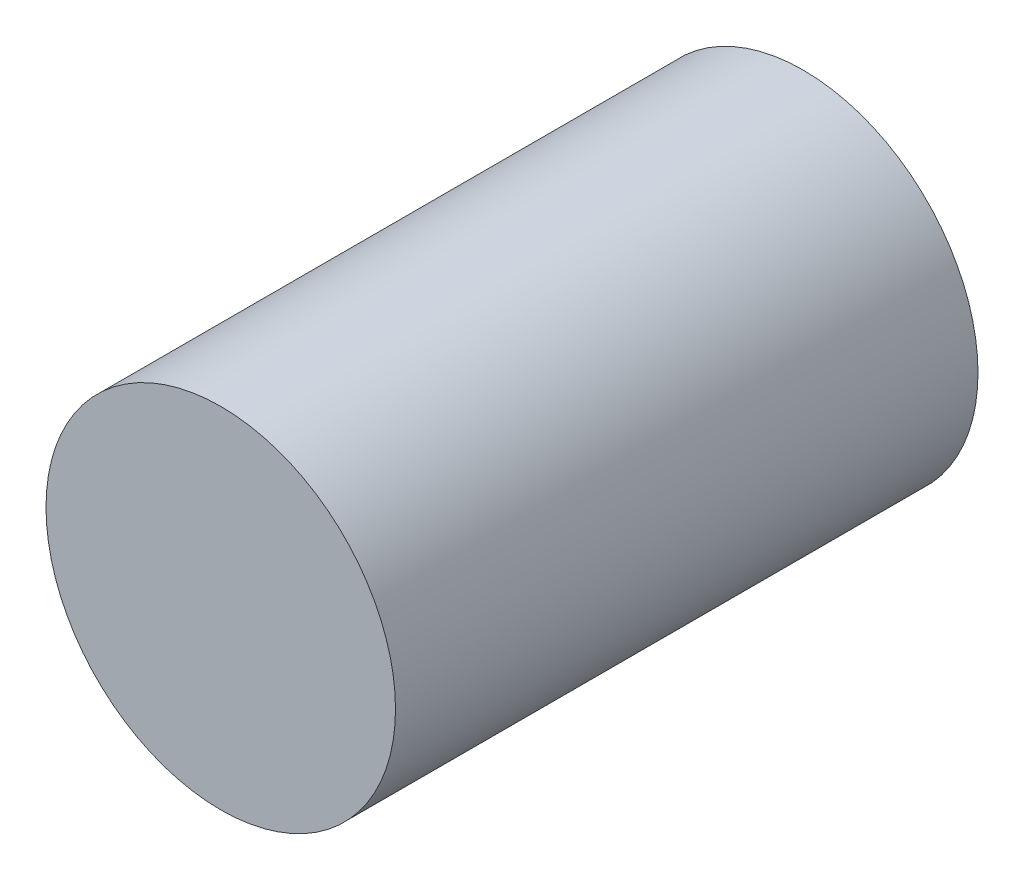
ISO-10303-21;
HEADER;
FILE_DESCRIPTION(('STEP AP214'),'2;1');
FILE_NAME('part.step','',(''),(''),'','','');
FILE_SCHEMA(('AUTOMOTIVE_DESIGN { 1 0 10303 214 1 1 1 1 }'));
ENDSEC;
DATA;
#1=APPLICATION_CONTEXT('core data for automotive mechanical design processes');
#2=APPLICATION_PROTOCOL_DEFINITION('international standard','automotive_design',2000,#1);
#3=PRODUCT_CONTEXT('',#1,'mechanical');
#4=PRODUCT('Part','Part','',(#3));
#5=PRODUCT_RELATED_PRODUCT_CATEGORY('part','',(#4));
#6=PRODUCT_DEFINITION_FORMATION('','',#4);
#7=PRODUCT_DEFINITION_CONTEXT('part definition',#1,'design');
#8=PRODUCT_DEFINITION('design','',#6,#7);
#9=PRODUCT_DEFINITION_SHAPE('','',#8);
#10=(LENGTH_UNIT() NAMED_UNIT(*) SI_UNIT(.MILLI.,.METRE.));
#11=(NAMED_UNIT(*) PLANE_ANGLE_UNIT() SI_UNIT($,.RADIAN.));
#12=(NAMED_UNIT(*) SI_UNIT($,.STERADIAN.) SOLID_ANGLE_UNIT());
#13=UNCERTAINTY_MEASURE_WITH_UNIT(LENGTH_MEASURE(1.E-05),#10,'distance_accuracy_value','');
#14=(GEOMETRIC_REPRESENTATION_CONTEXT(3) GLOBAL_UNCERTAINTY_ASSIGNED_CONTEXT((#13)) GLOBAL_UNIT_ASSIGNED_CONTEXT((#10,
#11,#12)) REPRESENTATION_CONTEXT('',''));
#15=CARTESIAN_POINT('',(0.,0.,0.));
#16=DIRECTION('',(0.,0.,1.));
#17=DIRECTION('',(1.,0.,0.));
#18=AXIS2_PLACEMENT_3D('',#15,#16,#17);
#19=CARTESIAN_POINT('',(0.,0.,10.));
#20=DIRECTION('',(0.,0.,-1.));
#21=DIRECTION('',(-1.,0.,0.));
#22=AXIS2_PLACEMENT_3D('',#19,#20,#21);
#23=CYLINDRICAL_SURFACE('',#22,3.);
#24=CARTESIAN_POINT('',(0.,0.,10.));
#25=DIRECTION('',(0.,0.,1.));
#26=DIRECTION('',(1.,0.,0.));
#27=AXIS2_PLACEMENT_3D('',#24,#25,#26);
#28=CIRCLE('',#27,3.);
#29=CARTESIAN_POINT('',(3.,0.,10.));
#30=VERTEX_POINT('',#29);
#31=EDGE_CURVE('E10',#30,#30,#28,.T.);
#32=ORIENTED_EDGE('',*,*,#31,.F.);
#33=EDGE_LOOP('',(#32));
#34=FACE_BOUND('',#33,.T.);
#35=CARTESIAN_POINT('',(0.,0.,0.));
#36=DIRECTION('',(0.,0.,1.));
#37=DIRECTION('',(1.,0.,0.));
#38=AXIS2_PLACEMENT_3D('',#35,#36,#37);
#39=CIRCLE('',#38,3.);
#40=CARTESIAN_POINT('',(3.,0.,0.));
#41=VERTEX_POINT('',#40);
#42=EDGE_CURVE('E42',#41,#41,#39,.T.);
#43=ORIENTED_EDGE('',*,*,#42,.T.);
#44=EDGE_LOOP('',(#43));
#45=FACE_BOUND('',#44,.T.);
#46=ADVANCED_FACE('F39',(#34,#45),#23,.T.);
#47=CARTESIAN_POINT('',(0.,0.,10.));
#48=DIRECTION('',(0.,0.,1.));
#49=DIRECTION('',(1.,0.,0.));
#50=AXIS2_PLACEMENT_3D('',#47,#48,#49);
#51=PLANE('',#50);
#52=ORIENTED_EDGE('',*,*,#31,.T.);
#53=EDGE_LOOP('',(#52));
#54=FACE_BOUND('',#53,.T.);
#55=ADVANCED_FACE('F54',(#54),#51,.T.);
#56=CARTESIAN_POINT('',(0.,0.,0.));
#57=DIRECTION('',(0.,0.,1.));
#58=DIRECTION('',(1.,0.,0.));
#59=AXIS2_PLACEMENT_3D('',#56,#57,#58);
#60=PLANE('',#59);
#61=ORIENTED_EDGE('',*,*,#42,.F.);
#62=EDGE_LOOP('',(#61));
#63=FACE_BOUND('',#62,.T.);
#64=ADVANCED_FACE('F52',(#63),#60,.F.);
#65=CLOSED_SHELL('',(#46,#55,#64));
#66=MANIFOLD_SOLID_BREP('B2',#65);
#67=ADVANCED_BREP_SHAPE_REPRESENTATION('',(#18,#66),#14);
#68=SHAPE_DEFINITION_REPRESENTATION(#9,#67);
ENDSEC;
END-ISO-10303-21;
